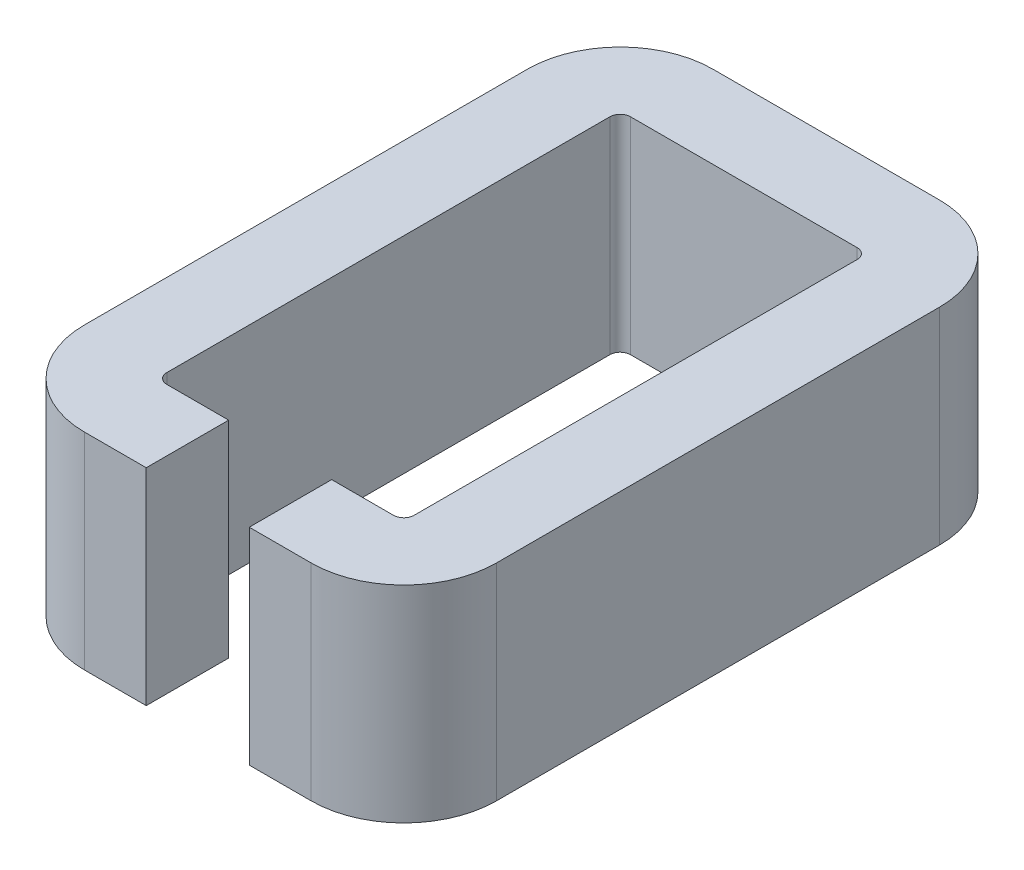
ISO-10303-21;
HEADER;
FILE_DESCRIPTION(('STEP AP214'),'2;1');
FILE_NAME('part.step','',(''),(''),'','','');
FILE_SCHEMA(('AUTOMOTIVE_DESIGN { 1 0 10303 214 1 1 1 1 }'));
ENDSEC;
DATA;
#1=APPLICATION_CONTEXT('core data for automotive mechanical design processes');
#2=APPLICATION_PROTOCOL_DEFINITION('international standard','automotive_design',2000,#1);
#3=PRODUCT_CONTEXT('',#1,'mechanical');
#4=PRODUCT('Part','Part','',(#3));
#5=PRODUCT_RELATED_PRODUCT_CATEGORY('part','',(#4));
#6=PRODUCT_DEFINITION_FORMATION('','',#4);
#7=PRODUCT_DEFINITION_CONTEXT('part definition',#1,'design');
#8=PRODUCT_DEFINITION('design','',#6,#7);
#9=PRODUCT_DEFINITION_SHAPE('','',#8);
#10=(LENGTH_UNIT() NAMED_UNIT(*) SI_UNIT(.MILLI.,.METRE.));
#11=(NAMED_UNIT(*) PLANE_ANGLE_UNIT() SI_UNIT($,.RADIAN.));
#12=(NAMED_UNIT(*) SI_UNIT($,.STERADIAN.) SOLID_ANGLE_UNIT());
#13=UNCERTAINTY_MEASURE_WITH_UNIT(LENGTH_MEASURE(1.E-05),#10,'distance_accuracy_value','');
#14=(GEOMETRIC_REPRESENTATION_CONTEXT(3) GLOBAL_UNCERTAINTY_ASSIGNED_CONTEXT((#13)) GLOBAL_UNIT_ASSIGNED_CONTEXT((#10,
#11,#12)) REPRESENTATION_CONTEXT('',''));
#15=CARTESIAN_POINT('',(0.,0.,0.));
#16=DIRECTION('',(0.,0.,1.));
#17=DIRECTION('',(1.,0.,0.));
#18=AXIS2_PLACEMENT_3D('',#15,#16,#17);
#19=CARTESIAN_POINT('',(11.5,10.,22.));
#20=DIRECTION('',(0.,-1.,0.));
#21=DIRECTION('',(0.,0.,-1.));
#22=AXIS2_PLACEMENT_3D('',#19,#20,#21);
#23=CYLINDRICAL_SURFACE('',#22,0.5);
#24=CARTESIAN_POINT('',(11.5,0.,22.));
#25=DIRECTION('',(0.,-1.,0.));
#26=DIRECTION('',(0.,0.,-1.));
#27=AXIS2_PLACEMENT_3D('',#24,#25,#26);
#28=CIRCLE('',#27,0.5);
#29=CARTESIAN_POINT('',(12.,0.,22.));
#30=VERTEX_POINT('',#29);
#31=CARTESIAN_POINT('',(11.5,0.,22.5));
#32=VERTEX_POINT('',#31);
#33=EDGE_CURVE('E212',#30,#32,#28,.T.);
#34=ORIENTED_EDGE('',*,*,#33,.T.);
#35=DIRECTION('',(0.,-1.,0.));
#36=VECTOR('',#35,1.);
#37=CARTESIAN_POINT('',(11.5,10.,22.5));
#38=LINE('',#37,#36);
#39=CARTESIAN_POINT('',(11.5,10.,22.5));
#40=VERTEX_POINT('',#39);
#41=EDGE_CURVE('E11',#40,#32,#38,.T.);
#42=ORIENTED_EDGE('',*,*,#41,.F.);
#43=CARTESIAN_POINT('',(11.5,10.,22.));
#44=DIRECTION('',(0.,-1.,0.));
#45=DIRECTION('',(0.,0.,-1.));
#46=AXIS2_PLACEMENT_3D('',#43,#44,#45);
#47=CIRCLE('',#46,0.5);
#48=CARTESIAN_POINT('',(12.,10.,22.));
#49=VERTEX_POINT('',#48);
#50=EDGE_CURVE('E270',#49,#40,#47,.T.);
#51=ORIENTED_EDGE('',*,*,#50,.F.);
#52=DIRECTION('',(0.,-1.,0.));
#53=VECTOR('',#52,1.);
#54=CARTESIAN_POINT('',(12.,10.,22.));
#55=LINE('',#54,#53);
#56=EDGE_CURVE('E208',#49,#30,#55,.T.);
#57=ORIENTED_EDGE('',*,*,#56,.T.);
#58=EDGE_LOOP('',(#34,#42,#51,#57));
#59=FACE_BOUND('',#58,.T.);
#60=ADVANCED_FACE('F39',(#59),#23,.F.);
#61=CARTESIAN_POINT('',(8.5,10.,22.5));
#62=DIRECTION('',(0.,0.,1.));
#63=DIRECTION('',(1.,0.,0.));
#64=AXIS2_PLACEMENT_3D('',#61,#62,#63);
#65=PLANE('',#64);
#66=DIRECTION('',(-1.,0.,0.));
#67=VECTOR('',#66,1.);
#68=CARTESIAN_POINT('',(8.5,0.,22.5));
#69=LINE('',#68,#67);
#70=CARTESIAN_POINT('',(8.5,0.,22.5));
#71=VERTEX_POINT('',#70);
#72=EDGE_CURVE('E216',#32,#71,#69,.T.);
#73=ORIENTED_EDGE('',*,*,#72,.T.);
#74=DIRECTION('',(0.,-1.,0.));
#75=VECTOR('',#74,1.);
#76=CARTESIAN_POINT('',(8.5,10.,22.5));
#77=LINE('',#76,#75);
#78=CARTESIAN_POINT('',(8.5,10.,22.5));
#79=VERTEX_POINT('',#78);
#80=EDGE_CURVE('E48',#79,#71,#77,.T.);
#81=ORIENTED_EDGE('',*,*,#80,.F.);
#82=DIRECTION('',(-1.,0.,0.));
#83=VECTOR('',#82,1.);
#84=CARTESIAN_POINT('',(8.5,10.,22.5));
#85=LINE('',#84,#83);
#86=EDGE_CURVE('E135',#40,#79,#85,.T.);
#87=ORIENTED_EDGE('',*,*,#86,.F.);
#88=ORIENTED_EDGE('',*,*,#41,.T.);
#89=EDGE_LOOP('',(#73,#81,#87,#88));
#90=FACE_BOUND('',#89,.T.);
#91=ADVANCED_FACE('F420',(#90),#65,.F.);
#92=CARTESIAN_POINT('',(8.5,10.,22.5));
#93=DIRECTION('',(1.,0.,0.));
#94=DIRECTION('',(0.,0.,-1.));
#95=AXIS2_PLACEMENT_3D('',#92,#93,#94);
#96=PLANE('',#95);
#97=DIRECTION('',(0.,0.,1.));
#98=VECTOR('',#97,1.);
#99=CARTESIAN_POINT('',(8.5,0.,22.5));
#100=LINE('',#99,#98);
#101=CARTESIAN_POINT('',(8.5,0.,26.5));
#102=VERTEX_POINT('',#101);
#103=EDGE_CURVE('E219',#71,#102,#100,.T.);
#104=ORIENTED_EDGE('',*,*,#103,.T.);
#105=DIRECTION('',(0.,-1.,0.));
#106=VECTOR('',#105,1.);
#107=CARTESIAN_POINT('',(8.5,10.,26.5));
#108=LINE('',#107,#106);
#109=CARTESIAN_POINT('',(8.5,10.,26.5));
#110=VERTEX_POINT('',#109);
#111=EDGE_CURVE('E329',#110,#102,#108,.T.);
#112=ORIENTED_EDGE('',*,*,#111,.F.);
#113=DIRECTION('',(0.,0.,1.));
#114=VECTOR('',#113,1.);
#115=CARTESIAN_POINT('',(8.5,10.,22.5));
#116=LINE('',#115,#114);
#117=EDGE_CURVE('E339',#79,#110,#116,.T.);
#118=ORIENTED_EDGE('',*,*,#117,.F.);
#119=ORIENTED_EDGE('',*,*,#80,.T.);
#120=EDGE_LOOP('',(#104,#112,#118,#119));
#121=FACE_BOUND('',#120,.T.);
#122=ADVANCED_FACE('F337',(#121),#96,.F.);
#123=CARTESIAN_POINT('',(8.5,10.,26.5));
#124=DIRECTION('',(0.,0.,-1.));
#125=DIRECTION('',(-1.,0.,0.));
#126=AXIS2_PLACEMENT_3D('',#123,#124,#125);
#127=PLANE('',#126);
#128=DIRECTION('',(1.,0.,0.));
#129=VECTOR('',#128,1.);
#130=CARTESIAN_POINT('',(8.5,0.,26.5));
#131=LINE('',#130,#129);
#132=CARTESIAN_POINT('',(11.5,0.,26.5));
#133=VERTEX_POINT('',#132);
#134=EDGE_CURVE('E222',#102,#133,#131,.T.);
#135=ORIENTED_EDGE('',*,*,#134,.T.);
#136=DIRECTION('',(0.,-1.,0.));
#137=VECTOR('',#136,1.);
#138=CARTESIAN_POINT('',(11.5,10.,26.5));
#139=LINE('',#138,#137);
#140=CARTESIAN_POINT('',(11.5,10.,26.5));
#141=VERTEX_POINT('',#140);
#142=EDGE_CURVE('E325',#141,#133,#139,.T.);
#143=ORIENTED_EDGE('',*,*,#142,.F.);
#144=DIRECTION('',(1.,0.,0.));
#145=VECTOR('',#144,1.);
#146=CARTESIAN_POINT('',(8.5,10.,26.5));
#147=LINE('',#146,#145);
#148=EDGE_CURVE('E358',#110,#141,#147,.T.);
#149=ORIENTED_EDGE('',*,*,#148,.F.);
#150=ORIENTED_EDGE('',*,*,#111,.T.);
#151=EDGE_LOOP('',(#135,#143,#149,#150));
#152=FACE_BOUND('',#151,.T.);
#153=ADVANCED_FACE('F348',(#152),#127,.F.);
#154=CARTESIAN_POINT('',(11.5,10.,22.));
#155=DIRECTION('',(0.,-1.,0.));
#156=DIRECTION('',(0.,0.,-1.));
#157=AXIS2_PLACEMENT_3D('',#154,#155,#156);
#158=CYLINDRICAL_SURFACE('',#157,4.5);
#159=CARTESIAN_POINT('',(11.5,0.,22.));
#160=DIRECTION('',(0.,1.,0.));
#161=DIRECTION('',(0.,0.,-1.));
#162=AXIS2_PLACEMENT_3D('',#159,#160,#161);
#163=CIRCLE('',#162,4.5);
#164=CARTESIAN_POINT('',(16.,0.,22.));
#165=VERTEX_POINT('',#164);
#166=EDGE_CURVE('E225',#133,#165,#163,.T.);
#167=ORIENTED_EDGE('',*,*,#166,.T.);
#168=DIRECTION('',(0.,-1.,0.));
#169=VECTOR('',#168,1.);
#170=CARTESIAN_POINT('',(16.,10.,22.));
#171=LINE('',#170,#169);
#172=CARTESIAN_POINT('',(16.,10.,22.));
#173=VERTEX_POINT('',#172);
#174=EDGE_CURVE('E321',#173,#165,#171,.T.);
#175=ORIENTED_EDGE('',*,*,#174,.F.);
#176=CARTESIAN_POINT('',(11.5,10.,22.));
#177=DIRECTION('',(0.,1.,0.));
#178=DIRECTION('',(0.,0.,-1.));
#179=AXIS2_PLACEMENT_3D('',#176,#177,#178);
#180=CIRCLE('',#179,4.5);
#181=EDGE_CURVE('E354',#141,#173,#180,.T.);
#182=ORIENTED_EDGE('',*,*,#181,.F.);
#183=ORIENTED_EDGE('',*,*,#142,.T.);
#184=EDGE_LOOP('',(#167,#175,#182,#183));
#185=FACE_BOUND('',#184,.T.);
#186=ADVANCED_FACE('F352',(#185),#158,.T.);
#187=CARTESIAN_POINT('',(16.,10.,0.500000000000004));
#188=DIRECTION('',(-1.,0.,0.));
#189=DIRECTION('',(0.,0.,1.));
#190=AXIS2_PLACEMENT_3D('',#187,#188,#189);
#191=PLANE('',#190);
#192=DIRECTION('',(0.,0.,-1.));
#193=VECTOR('',#192,1.);
#194=CARTESIAN_POINT('',(16.,0.,0.500000000000004));
#195=LINE('',#194,#193);
#196=CARTESIAN_POINT('',(16.,0.,0.500000000000003));
#197=VERTEX_POINT('',#196);
#198=EDGE_CURVE('E228',#165,#197,#195,.T.);
#199=ORIENTED_EDGE('',*,*,#198,.T.);
#200=DIRECTION('',(0.,-1.,0.));
#201=VECTOR('',#200,1.);
#202=CARTESIAN_POINT('',(16.,10.,0.500000000000003));
#203=LINE('',#202,#201);
#204=CARTESIAN_POINT('',(16.,10.,0.500000000000003));
#205=VERTEX_POINT('',#204);
#206=EDGE_CURVE('E317',#205,#197,#203,.T.);
#207=ORIENTED_EDGE('',*,*,#206,.F.);
#208=DIRECTION('',(0.,0.,-1.));
#209=VECTOR('',#208,1.);
#210=CARTESIAN_POINT('',(16.,10.,0.500000000000004));
#211=LINE('',#210,#209);
#212=EDGE_CURVE('E357',#173,#205,#211,.T.);
#213=ORIENTED_EDGE('',*,*,#212,.F.);
#214=ORIENTED_EDGE('',*,*,#174,.T.);
#215=EDGE_LOOP('',(#199,#207,#213,#214));
#216=FACE_BOUND('',#215,.T.);
#217=ADVANCED_FACE('F433',(#216),#191,.F.);
#218=CARTESIAN_POINT('',(11.5,10.,0.5));
#219=DIRECTION('',(0.,-1.,0.));
#220=DIRECTION('',(0.,0.,-1.));
#221=AXIS2_PLACEMENT_3D('',#218,#219,#220);
#222=CYLINDRICAL_SURFACE('',#221,4.5);
#223=CARTESIAN_POINT('',(11.5,0.,0.5));
#224=DIRECTION('',(0.,1.,0.));
#225=DIRECTION('',(0.,0.,1.));
#226=AXIS2_PLACEMENT_3D('',#223,#224,#225);
#227=CIRCLE('',#226,4.5);
#228=CARTESIAN_POINT('',(11.5,0.,-4.));
#229=VERTEX_POINT('',#228);
#230=EDGE_CURVE('E231',#197,#229,#227,.T.);
#231=ORIENTED_EDGE('',*,*,#230,.T.);
#232=DIRECTION('',(0.,-1.,0.));
#233=VECTOR('',#232,1.);
#234=CARTESIAN_POINT('',(11.5,10.,-4.));
#235=LINE('',#234,#233);
#236=CARTESIAN_POINT('',(11.5,10.,-4.));
#237=VERTEX_POINT('',#236);
#238=EDGE_CURVE('E313',#237,#229,#235,.T.);
#239=ORIENTED_EDGE('',*,*,#238,.F.);
#240=CARTESIAN_POINT('',(11.5,10.,0.5));
#241=DIRECTION('',(0.,1.,0.));
#242=DIRECTION('',(0.,0.,1.));
#243=AXIS2_PLACEMENT_3D('',#240,#241,#242);
#244=CIRCLE('',#243,4.5);
#245=EDGE_CURVE('E362',#205,#237,#244,.T.);
#246=ORIENTED_EDGE('',*,*,#245,.F.);
#247=ORIENTED_EDGE('',*,*,#206,.T.);
#248=EDGE_LOOP('',(#231,#239,#246,#247));
#249=FACE_BOUND('',#248,.T.);
#250=ADVANCED_FACE('F436',(#249),#222,.T.);
#251=CARTESIAN_POINT('',(0.500000000000004,10.,-4.));
#252=DIRECTION('',(0.,0.,1.));
#253=DIRECTION('',(1.,0.,0.));
#254=AXIS2_PLACEMENT_3D('',#251,#252,#253);
#255=PLANE('',#254);
#256=DIRECTION('',(-1.,0.,0.));
#257=VECTOR('',#256,1.);
#258=CARTESIAN_POINT('',(0.500000000000004,0.,-4.));
#259=LINE('',#258,#257);
#260=CARTESIAN_POINT('',(0.500000000000005,0.,-4.));
#261=VERTEX_POINT('',#260);
#262=EDGE_CURVE('E234',#229,#261,#259,.T.);
#263=ORIENTED_EDGE('',*,*,#262,.T.);
#264=DIRECTION('',(0.,-1.,0.));
#265=VECTOR('',#264,1.);
#266=CARTESIAN_POINT('',(0.500000000000005,10.,-4.));
#267=LINE('',#266,#265);
#268=CARTESIAN_POINT('',(0.500000000000005,10.,-4.));
#269=VERTEX_POINT('',#268);
#270=EDGE_CURVE('E309',#269,#261,#267,.T.);
#271=ORIENTED_EDGE('',*,*,#270,.F.);
#272=DIRECTION('',(-1.,0.,0.));
#273=VECTOR('',#272,1.);
#274=CARTESIAN_POINT('',(0.500000000000004,10.,-4.));
#275=LINE('',#274,#273);
#276=EDGE_CURVE('E369',#237,#269,#275,.T.);
#277=ORIENTED_EDGE('',*,*,#276,.F.);
#278=ORIENTED_EDGE('',*,*,#238,.T.);
#279=EDGE_LOOP('',(#263,#271,#277,#278));
#280=FACE_BOUND('',#279,.T.);
#281=ADVANCED_FACE('F440',(#280),#255,.F.);
#282=CARTESIAN_POINT('',(0.5,10.,0.5));
#283=DIRECTION('',(0.,-1.,0.));
#284=DIRECTION('',(0.,0.,-1.));
#285=AXIS2_PLACEMENT_3D('',#282,#283,#284);
#286=CYLINDRICAL_SURFACE('',#285,4.5);
#287=CARTESIAN_POINT('',(0.5,0.,0.5));
#288=DIRECTION('',(0.,1.,0.));
#289=DIRECTION('',(0.,0.,1.));
#290=AXIS2_PLACEMENT_3D('',#287,#288,#289);
#291=CIRCLE('',#290,4.5);
#292=CARTESIAN_POINT('',(-4.,0.,0.500000000000004));
#293=VERTEX_POINT('',#292);
#294=EDGE_CURVE('E237',#261,#293,#291,.T.);
#295=ORIENTED_EDGE('',*,*,#294,.T.);
#296=DIRECTION('',(0.,-1.,0.));
#297=VECTOR('',#296,1.);
#298=CARTESIAN_POINT('',(-4.,10.,0.500000000000004));
#299=LINE('',#298,#297);
#300=CARTESIAN_POINT('',(-4.,10.,0.500000000000004));
#301=VERTEX_POINT('',#300);
#302=EDGE_CURVE('E305',#301,#293,#299,.T.);
#303=ORIENTED_EDGE('',*,*,#302,.F.);
#304=CARTESIAN_POINT('',(0.5,10.,0.5));
#305=DIRECTION('',(0.,1.,0.));
#306=DIRECTION('',(0.,0.,1.));
#307=AXIS2_PLACEMENT_3D('',#304,#305,#306);
#308=CIRCLE('',#307,4.5);
#309=EDGE_CURVE('E372',#269,#301,#308,.T.);
#310=ORIENTED_EDGE('',*,*,#309,.F.);
#311=ORIENTED_EDGE('',*,*,#270,.T.);
#312=EDGE_LOOP('',(#295,#303,#310,#311));
#313=FACE_BOUND('',#312,.T.);
#314=ADVANCED_FACE('F444',(#313),#286,.T.);
#315=CARTESIAN_POINT('',(-4.,10.,0.500000000000004));
#316=DIRECTION('',(1.,0.,0.));
#317=DIRECTION('',(0.,0.,-1.));
#318=AXIS2_PLACEMENT_3D('',#315,#316,#317);
#319=PLANE('',#318);
#320=DIRECTION('',(0.,0.,1.));
#321=VECTOR('',#320,1.);
#322=CARTESIAN_POINT('',(-4.,0.,0.500000000000004));
#323=LINE('',#322,#321);
#324=CARTESIAN_POINT('',(-4.,0.,22.));
#325=VERTEX_POINT('',#324);
#326=EDGE_CURVE('E240',#293,#325,#323,.T.);
#327=ORIENTED_EDGE('',*,*,#326,.T.);
#328=DIRECTION('',(0.,-1.,0.));
#329=VECTOR('',#328,1.);
#330=CARTESIAN_POINT('',(-4.,10.,22.));
#331=LINE('',#330,#329);
#332=CARTESIAN_POINT('',(-4.,10.,22.));
#333=VERTEX_POINT('',#332);
#334=EDGE_CURVE('E301',#333,#325,#331,.T.);
#335=ORIENTED_EDGE('',*,*,#334,.F.);
#336=DIRECTION('',(0.,0.,1.));
#337=VECTOR('',#336,1.);
#338=CARTESIAN_POINT('',(-4.,10.,0.500000000000004));
#339=LINE('',#338,#337);
#340=EDGE_CURVE('E375',#301,#333,#339,.T.);
#341=ORIENTED_EDGE('',*,*,#340,.F.);
#342=ORIENTED_EDGE('',*,*,#302,.T.);
#343=EDGE_LOOP('',(#327,#335,#341,#342));
#344=FACE_BOUND('',#343,.T.);
#345=ADVANCED_FACE('F448',(#344),#319,.F.);
#346=CARTESIAN_POINT('',(0.500000000000003,10.,22.));
#347=DIRECTION('',(0.,-1.,0.));
#348=DIRECTION('',(0.,0.,-1.));
#349=AXIS2_PLACEMENT_3D('',#346,#347,#348);
#350=CYLINDRICAL_SURFACE('',#349,4.5);
#351=CARTESIAN_POINT('',(0.500000000000003,0.,22.));
#352=DIRECTION('',(0.,1.,0.));
#353=DIRECTION('',(0.,0.,-1.));
#354=AXIS2_PLACEMENT_3D('',#351,#352,#353);
#355=CIRCLE('',#354,4.5);
#356=CARTESIAN_POINT('',(0.500000000000034,0.,26.5));
#357=VERTEX_POINT('',#356);
#358=EDGE_CURVE('E243',#325,#357,#355,.T.);
#359=ORIENTED_EDGE('',*,*,#358,.T.);
#360=DIRECTION('',(0.,-1.,0.));
#361=VECTOR('',#360,1.);
#362=CARTESIAN_POINT('',(0.500000000000034,10.,26.5));
#363=LINE('',#362,#361);
#364=CARTESIAN_POINT('',(0.500000000000034,10.,26.5));
#365=VERTEX_POINT('',#364);
#366=EDGE_CURVE('E297',#365,#357,#363,.T.);
#367=ORIENTED_EDGE('',*,*,#366,.F.);
#368=CARTESIAN_POINT('',(0.500000000000003,10.,22.));
#369=DIRECTION('',(0.,1.,0.));
#370=DIRECTION('',(0.,0.,-1.));
#371=AXIS2_PLACEMENT_3D('',#368,#369,#370);
#372=CIRCLE('',#371,4.5);
#373=EDGE_CURVE('E378',#333,#365,#372,.T.);
#374=ORIENTED_EDGE('',*,*,#373,.F.);
#375=ORIENTED_EDGE('',*,*,#334,.T.);
#376=EDGE_LOOP('',(#359,#367,#374,#375));
#377=FACE_BOUND('',#376,.T.);
#378=ADVANCED_FACE('F452',(#377),#350,.T.);
#379=CARTESIAN_POINT('',(0.500000000000034,10.,26.5));
#380=DIRECTION('',(0.,0.,-1.));
#381=DIRECTION('',(-1.,0.,0.));
#382=AXIS2_PLACEMENT_3D('',#379,#380,#381);
#383=PLANE('',#382);
#384=DIRECTION('',(1.,0.,0.));
#385=VECTOR('',#384,1.);
#386=CARTESIAN_POINT('',(0.500000000000034,0.,26.5));
#387=LINE('',#386,#385);
#388=CARTESIAN_POINT('',(3.5,0.,26.5));
#389=VERTEX_POINT('',#388);
#390=EDGE_CURVE('E246',#357,#389,#387,.T.);
#391=ORIENTED_EDGE('',*,*,#390,.T.);
#392=DIRECTION('',(0.,-1.,0.));
#393=VECTOR('',#392,1.);
#394=CARTESIAN_POINT('',(3.5,10.,26.5));
#395=LINE('',#394,#393);
#396=CARTESIAN_POINT('',(3.5,10.,26.5));
#397=VERTEX_POINT('',#396);
#398=EDGE_CURVE('E293',#397,#389,#395,.T.);
#399=ORIENTED_EDGE('',*,*,#398,.F.);
#400=DIRECTION('',(1.,0.,0.));
#401=VECTOR('',#400,1.);
#402=CARTESIAN_POINT('',(0.500000000000034,10.,26.5));
#403=LINE('',#402,#401);
#404=EDGE_CURVE('E381',#365,#397,#403,.T.);
#405=ORIENTED_EDGE('',*,*,#404,.F.);
#406=ORIENTED_EDGE('',*,*,#366,.T.);
#407=EDGE_LOOP('',(#391,#399,#405,#406));
#408=FACE_BOUND('',#407,.T.);
#409=ADVANCED_FACE('F456',(#408),#383,.F.);
#410=CARTESIAN_POINT('',(3.5,10.,22.5));
#411=DIRECTION('',(-1.,0.,0.));
#412=DIRECTION('',(0.,0.,1.));
#413=AXIS2_PLACEMENT_3D('',#410,#411,#412);
#414=PLANE('',#413);
#415=DIRECTION('',(0.,0.,-1.));
#416=VECTOR('',#415,1.);
#417=CARTESIAN_POINT('',(3.5,0.,22.5));
#418=LINE('',#417,#416);
#419=CARTESIAN_POINT('',(3.5,0.,22.5));
#420=VERTEX_POINT('',#419);
#421=EDGE_CURVE('E249',#389,#420,#418,.T.);
#422=ORIENTED_EDGE('',*,*,#421,.T.);
#423=DIRECTION('',(0.,-1.,0.));
#424=VECTOR('',#423,1.);
#425=CARTESIAN_POINT('',(3.5,10.,22.5));
#426=LINE('',#425,#424);
#427=CARTESIAN_POINT('',(3.5,10.,22.5));
#428=VERTEX_POINT('',#427);
#429=EDGE_CURVE('E289',#428,#420,#426,.T.);
#430=ORIENTED_EDGE('',*,*,#429,.F.);
#431=DIRECTION('',(0.,0.,-1.));
#432=VECTOR('',#431,1.);
#433=CARTESIAN_POINT('',(3.5,10.,22.5));
#434=LINE('',#433,#432);
#435=EDGE_CURVE('E384',#397,#428,#434,.T.);
#436=ORIENTED_EDGE('',*,*,#435,.F.);
#437=ORIENTED_EDGE('',*,*,#398,.T.);
#438=EDGE_LOOP('',(#422,#430,#436,#437));
#439=FACE_BOUND('',#438,.T.);
#440=ADVANCED_FACE('F460',(#439),#414,.F.);
#441=CARTESIAN_POINT('',(0.500000000000006,10.,22.5));
#442=DIRECTION('',(0.,0.,1.));
#443=DIRECTION('',(1.,0.,0.));
#444=AXIS2_PLACEMENT_3D('',#441,#442,#443);
#445=PLANE('',#444);
#446=DIRECTION('',(-1.,0.,0.));
#447=VECTOR('',#446,1.);
#448=CARTESIAN_POINT('',(0.500000000000006,0.,22.5));
#449=LINE('',#448,#447);
#450=CARTESIAN_POINT('',(0.500000000000006,0.,22.5));
#451=VERTEX_POINT('',#450);
#452=EDGE_CURVE('E252',#420,#451,#449,.T.);
#453=ORIENTED_EDGE('',*,*,#452,.T.);
#454=DIRECTION('',(0.,-1.,0.));
#455=VECTOR('',#454,1.);
#456=CARTESIAN_POINT('',(0.500000000000006,10.,22.5));
#457=LINE('',#456,#455);
#458=CARTESIAN_POINT('',(0.500000000000006,10.,22.5));
#459=VERTEX_POINT('',#458);
#460=EDGE_CURVE('E285',#459,#451,#457,.T.);
#461=ORIENTED_EDGE('',*,*,#460,.F.);
#462=DIRECTION('',(-1.,0.,0.));
#463=VECTOR('',#462,1.);
#464=CARTESIAN_POINT('',(0.500000000000006,10.,22.5));
#465=LINE('',#464,#463);
#466=EDGE_CURVE('E387',#428,#459,#465,.T.);
#467=ORIENTED_EDGE('',*,*,#466,.F.);
#468=ORIENTED_EDGE('',*,*,#429,.T.);
#469=EDGE_LOOP('',(#453,#461,#467,#468));
#470=FACE_BOUND('',#469,.T.);
#471=ADVANCED_FACE('F464',(#470),#445,.F.);
#472=CARTESIAN_POINT('',(0.500000000000003,10.,22.));
#473=DIRECTION('',(0.,-1.,0.));
#474=DIRECTION('',(0.,0.,-1.));
#475=AXIS2_PLACEMENT_3D('',#472,#473,#474);
#476=CYLINDRICAL_SURFACE('',#475,0.5);
#477=CARTESIAN_POINT('',(0.500000000000003,0.,22.));
#478=DIRECTION('',(0.,-1.,0.));
#479=DIRECTION('',(0.,0.,-1.));
#480=AXIS2_PLACEMENT_3D('',#477,#478,#479);
#481=CIRCLE('',#480,0.5);
#482=CARTESIAN_POINT('',(0.,0.,22.));
#483=VERTEX_POINT('',#482);
#484=EDGE_CURVE('E255',#451,#483,#481,.T.);
#485=ORIENTED_EDGE('',*,*,#484,.T.);
#486=DIRECTION('',(0.,-1.,0.));
#487=VECTOR('',#486,1.);
#488=CARTESIAN_POINT('',(0.,10.,22.));
#489=LINE('',#488,#487);
#490=CARTESIAN_POINT('',(0.,10.,22.));
#491=VERTEX_POINT('',#490);
#492=EDGE_CURVE('E281',#491,#483,#489,.T.);
#493=ORIENTED_EDGE('',*,*,#492,.F.);
#494=CARTESIAN_POINT('',(0.500000000000003,10.,22.));
#495=DIRECTION('',(0.,-1.,0.));
#496=DIRECTION('',(0.,0.,-1.));
#497=AXIS2_PLACEMENT_3D('',#494,#495,#496);
#498=CIRCLE('',#497,0.5);
#499=EDGE_CURVE('E390',#459,#491,#498,.T.);
#500=ORIENTED_EDGE('',*,*,#499,.F.);
#501=ORIENTED_EDGE('',*,*,#460,.T.);
#502=EDGE_LOOP('',(#485,#493,#500,#501));
#503=FACE_BOUND('',#502,.T.);
#504=ADVANCED_FACE('F468',(#503),#476,.F.);
#505=CARTESIAN_POINT('',(0.,10.,0.500000000000004));
#506=DIRECTION('',(-1.,0.,0.));
#507=DIRECTION('',(0.,0.,1.));
#508=AXIS2_PLACEMENT_3D('',#505,#506,#507);
#509=PLANE('',#508);
#510=DIRECTION('',(0.,0.,-1.));
#511=VECTOR('',#510,1.);
#512=CARTESIAN_POINT('',(0.,0.,0.500000000000004));
#513=LINE('',#512,#511);
#514=CARTESIAN_POINT('',(0.,0.,0.500000000000003));
#515=VERTEX_POINT('',#514);
#516=EDGE_CURVE('E258',#483,#515,#513,.T.);
#517=ORIENTED_EDGE('',*,*,#516,.T.);
#518=DIRECTION('',(0.,-1.,0.));
#519=VECTOR('',#518,1.);
#520=CARTESIAN_POINT('',(0.,10.,0.500000000000003));
#521=LINE('',#520,#519);
#522=CARTESIAN_POINT('',(0.,10.,0.500000000000003));
#523=VERTEX_POINT('',#522);
#524=EDGE_CURVE('E277',#523,#515,#521,.T.);
#525=ORIENTED_EDGE('',*,*,#524,.F.);
#526=DIRECTION('',(0.,0.,-1.));
#527=VECTOR('',#526,1.);
#528=CARTESIAN_POINT('',(0.,10.,0.500000000000004));
#529=LINE('',#528,#527);
#530=EDGE_CURVE('E393',#491,#523,#529,.T.);
#531=ORIENTED_EDGE('',*,*,#530,.F.);
#532=ORIENTED_EDGE('',*,*,#492,.T.);
#533=EDGE_LOOP('',(#517,#525,#531,#532));
#534=FACE_BOUND('',#533,.T.);
#535=ADVANCED_FACE('F401',(#534),#509,.F.);
#536=CARTESIAN_POINT('',(0.5,10.,0.5));
#537=DIRECTION('',(0.,-1.,0.));
#538=DIRECTION('',(0.,0.,-1.));
#539=AXIS2_PLACEMENT_3D('',#536,#537,#538);
#540=CYLINDRICAL_SURFACE('',#539,0.5);
#541=CARTESIAN_POINT('',(0.5,0.,0.5));
#542=DIRECTION('',(0.,-1.,0.));
#543=DIRECTION('',(0.,0.,1.));
#544=AXIS2_PLACEMENT_3D('',#541,#542,#543);
#545=CIRCLE('',#544,0.5);
#546=CARTESIAN_POINT('',(0.500000000000004,0.,0.));
#547=VERTEX_POINT('',#546);
#548=EDGE_CURVE('E261',#515,#547,#545,.T.);
#549=ORIENTED_EDGE('',*,*,#548,.T.);
#550=DIRECTION('',(0.,-1.,0.));
#551=VECTOR('',#550,1.);
#552=CARTESIAN_POINT('',(0.500000000000004,10.,0.));
#553=LINE('',#552,#551);
#554=CARTESIAN_POINT('',(0.500000000000004,10.,0.));
#555=VERTEX_POINT('',#554);
#556=EDGE_CURVE('E201',#555,#547,#553,.T.);
#557=ORIENTED_EDGE('',*,*,#556,.F.);
#558=CARTESIAN_POINT('',(0.5,10.,0.5));
#559=DIRECTION('',(0.,-1.,0.));
#560=DIRECTION('',(0.,0.,1.));
#561=AXIS2_PLACEMENT_3D('',#558,#559,#560);
#562=CIRCLE('',#561,0.5);
#563=EDGE_CURVE('E190',#523,#555,#562,.T.);
#564=ORIENTED_EDGE('',*,*,#563,.F.);
#565=ORIENTED_EDGE('',*,*,#524,.T.);
#566=EDGE_LOOP('',(#549,#557,#564,#565));
#567=FACE_BOUND('',#566,.T.);
#568=ADVANCED_FACE('F405',(#567),#540,.F.);
#569=CARTESIAN_POINT('',(0.500000000000004,10.,0.));
#570=DIRECTION('',(0.,0.,-1.));
#571=DIRECTION('',(-1.,0.,0.));
#572=AXIS2_PLACEMENT_3D('',#569,#570,#571);
#573=PLANE('',#572);
#574=DIRECTION('',(1.,0.,0.));
#575=VECTOR('',#574,1.);
#576=CARTESIAN_POINT('',(0.500000000000004,0.,0.));
#577=LINE('',#576,#575);
#578=CARTESIAN_POINT('',(11.5,0.,0.));
#579=VERTEX_POINT('',#578);
#580=EDGE_CURVE('E199',#547,#579,#577,.T.);
#581=ORIENTED_EDGE('',*,*,#580,.T.);
#582=DIRECTION('',(0.,-1.,0.));
#583=VECTOR('',#582,1.);
#584=CARTESIAN_POINT('',(11.5,10.,0.));
#585=LINE('',#584,#583);
#586=CARTESIAN_POINT('',(11.5,10.,0.));
#587=VERTEX_POINT('',#586);
#588=EDGE_CURVE('E196',#587,#579,#585,.T.);
#589=ORIENTED_EDGE('',*,*,#588,.F.);
#590=DIRECTION('',(1.,0.,0.));
#591=VECTOR('',#590,1.);
#592=CARTESIAN_POINT('',(0.500000000000004,10.,0.));
#593=LINE('',#592,#591);
#594=EDGE_CURVE('E184',#555,#587,#593,.T.);
#595=ORIENTED_EDGE('',*,*,#594,.F.);
#596=ORIENTED_EDGE('',*,*,#556,.T.);
#597=EDGE_LOOP('',(#581,#589,#595,#596));
#598=FACE_BOUND('',#597,.T.);
#599=ADVANCED_FACE('F197',(#598),#573,.F.);
#600=CARTESIAN_POINT('',(11.5,10.,0.5));
#601=DIRECTION('',(0.,-1.,0.));
#602=DIRECTION('',(0.,0.,-1.));
#603=AXIS2_PLACEMENT_3D('',#600,#601,#602);
#604=CYLINDRICAL_SURFACE('',#603,0.5);
#605=CARTESIAN_POINT('',(11.5,0.,0.5));
#606=DIRECTION('',(0.,-1.,0.));
#607=DIRECTION('',(0.,0.,1.));
#608=AXIS2_PLACEMENT_3D('',#605,#606,#607);
#609=CIRCLE('',#608,0.5);
#610=CARTESIAN_POINT('',(12.,0.,0.500000000000004));
#611=VERTEX_POINT('',#610);
#612=EDGE_CURVE('E121',#579,#611,#609,.T.);
#613=ORIENTED_EDGE('',*,*,#612,.T.);
#614=DIRECTION('',(0.,-1.,0.));
#615=VECTOR('',#614,1.);
#616=CARTESIAN_POINT('',(12.,10.,0.500000000000004));
#617=LINE('',#616,#615);
#618=CARTESIAN_POINT('',(12.,10.,0.500000000000004));
#619=VERTEX_POINT('',#618);
#620=EDGE_CURVE('E202',#619,#611,#617,.T.);
#621=ORIENTED_EDGE('',*,*,#620,.F.);
#622=CARTESIAN_POINT('',(11.5,10.,0.5));
#623=DIRECTION('',(0.,-1.,0.));
#624=DIRECTION('',(0.,0.,1.));
#625=AXIS2_PLACEMENT_3D('',#622,#623,#624);
#626=CIRCLE('',#625,0.5);
#627=EDGE_CURVE('E188',#587,#619,#626,.T.);
#628=ORIENTED_EDGE('',*,*,#627,.F.);
#629=ORIENTED_EDGE('',*,*,#588,.T.);
#630=EDGE_LOOP('',(#613,#621,#628,#629));
#631=FACE_BOUND('',#630,.T.);
#632=ADVANCED_FACE('F204',(#631),#604,.F.);
#633=CARTESIAN_POINT('',(12.,10.,0.500000000000004));
#634=DIRECTION('',(1.,0.,0.));
#635=DIRECTION('',(0.,0.,-1.));
#636=AXIS2_PLACEMENT_3D('',#633,#634,#635);
#637=PLANE('',#636);
#638=DIRECTION('',(0.,0.,1.));
#639=VECTOR('',#638,1.);
#640=CARTESIAN_POINT('',(12.,0.,0.500000000000004));
#641=LINE('',#640,#639);
#642=EDGE_CURVE('E127',#611,#30,#641,.T.);
#643=ORIENTED_EDGE('',*,*,#642,.T.);
#644=ORIENTED_EDGE('',*,*,#56,.F.);
#645=DIRECTION('',(0.,0.,1.));
#646=VECTOR('',#645,1.);
#647=CARTESIAN_POINT('',(12.,10.,0.500000000000004));
#648=LINE('',#647,#646);
#649=EDGE_CURVE('E56',#619,#49,#648,.T.);
#650=ORIENTED_EDGE('',*,*,#649,.F.);
#651=ORIENTED_EDGE('',*,*,#620,.T.);
#652=EDGE_LOOP('',(#643,#644,#650,#651));
#653=FACE_BOUND('',#652,.T.);
#654=ADVANCED_FACE('F409',(#653),#637,.F.);
#655=CARTESIAN_POINT('',(11.5,10.,22.));
#656=DIRECTION('',(0.,-1.,0.));
#657=DIRECTION('',(0.,0.,-1.));
#658=AXIS2_PLACEMENT_3D('',#655,#656,#657);
#659=PLANE('',#658);
#660=ORIENTED_EDGE('',*,*,#50,.T.);
#661=ORIENTED_EDGE('',*,*,#86,.T.);
#662=ORIENTED_EDGE('',*,*,#117,.T.);
#663=ORIENTED_EDGE('',*,*,#148,.T.);
#664=ORIENTED_EDGE('',*,*,#181,.T.);
#665=ORIENTED_EDGE('',*,*,#212,.T.);
#666=ORIENTED_EDGE('',*,*,#245,.T.);
#667=ORIENTED_EDGE('',*,*,#276,.T.);
#668=ORIENTED_EDGE('',*,*,#309,.T.);
#669=ORIENTED_EDGE('',*,*,#340,.T.);
#670=ORIENTED_EDGE('',*,*,#373,.T.);
#671=ORIENTED_EDGE('',*,*,#404,.T.);
#672=ORIENTED_EDGE('',*,*,#435,.T.);
#673=ORIENTED_EDGE('',*,*,#466,.T.);
#674=ORIENTED_EDGE('',*,*,#499,.T.);
#675=ORIENTED_EDGE('',*,*,#530,.T.);
#676=ORIENTED_EDGE('',*,*,#563,.T.);
#677=ORIENTED_EDGE('',*,*,#594,.T.);
#678=ORIENTED_EDGE('',*,*,#627,.T.);
#679=ORIENTED_EDGE('',*,*,#649,.T.);
#680=EDGE_LOOP('',(#660,#661,#662,#663,#664,#665,#666,#667,#668,#669,#670,#671,#672,#673,#674,
#675,#676,#677,#678,#679));
#681=FACE_BOUND('',#680,.T.);
#682=ADVANCED_FACE('F186',(#681),#659,.F.);
#683=CARTESIAN_POINT('',(11.5,0.,22.));
#684=DIRECTION('',(0.,-1.,0.));
#685=DIRECTION('',(0.,0.,-1.));
#686=AXIS2_PLACEMENT_3D('',#683,#684,#685);
#687=PLANE('',#686);
#688=ORIENTED_EDGE('',*,*,#33,.F.);
#689=ORIENTED_EDGE('',*,*,#642,.F.);
#690=ORIENTED_EDGE('',*,*,#612,.F.);
#691=ORIENTED_EDGE('',*,*,#580,.F.);
#692=ORIENTED_EDGE('',*,*,#548,.F.);
#693=ORIENTED_EDGE('',*,*,#516,.F.);
#694=ORIENTED_EDGE('',*,*,#484,.F.);
#695=ORIENTED_EDGE('',*,*,#452,.F.);
#696=ORIENTED_EDGE('',*,*,#421,.F.);
#697=ORIENTED_EDGE('',*,*,#390,.F.);
#698=ORIENTED_EDGE('',*,*,#358,.F.);
#699=ORIENTED_EDGE('',*,*,#326,.F.);
#700=ORIENTED_EDGE('',*,*,#294,.F.);
#701=ORIENTED_EDGE('',*,*,#262,.F.);
#702=ORIENTED_EDGE('',*,*,#230,.F.);
#703=ORIENTED_EDGE('',*,*,#198,.F.);
#704=ORIENTED_EDGE('',*,*,#166,.F.);
#705=ORIENTED_EDGE('',*,*,#134,.F.);
#706=ORIENTED_EDGE('',*,*,#103,.F.);
#707=ORIENTED_EDGE('',*,*,#72,.F.);
#708=EDGE_LOOP('',(#688,#689,#690,#691,#692,#693,#694,#695,#696,#697,#698,#699,#700,#701,#702,
#703,#704,#705,#706,#707));
#709=FACE_BOUND('',#708,.T.);
#710=ADVANCED_FACE('F343',(#709),#687,.T.);
#711=CLOSED_SHELL('',(#60,#91,#122,#153,#186,#217,#250,#281,#314,#345,#378,#409,#440,#471,#504,
#535,#568,#599,#632,#654,#682,#710));
#712=MANIFOLD_SOLID_BREP('B2',#711);
#713=ADVANCED_BREP_SHAPE_REPRESENTATION('',(#18,#712),#14);
#714=SHAPE_DEFINITION_REPRESENTATION(#9,#713);
ENDSEC;
END-ISO-10303-21;
